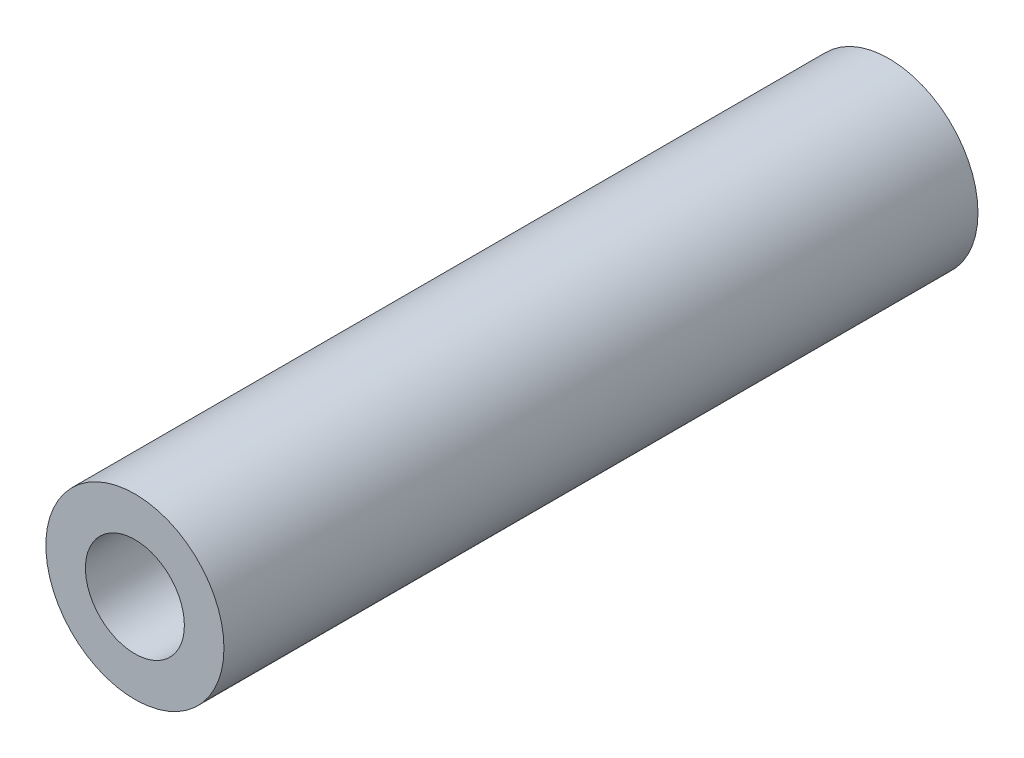
ISO-10303-21;
HEADER;
FILE_DESCRIPTION(('STEP AP214'),'2;1');
FILE_NAME('part.step','',(''),(''),'','','');
FILE_SCHEMA(('AUTOMOTIVE_DESIGN { 1 0 10303 214 1 1 1 1 }'));
ENDSEC;
DATA;
#1=APPLICATION_CONTEXT('core data for automotive mechanical design processes');
#2=APPLICATION_PROTOCOL_DEFINITION('international standard','automotive_design',2000,#1);
#3=PRODUCT_CONTEXT('',#1,'mechanical');
#4=PRODUCT('Part','Part','',(#3));
#5=PRODUCT_RELATED_PRODUCT_CATEGORY('part','',(#4));
#6=PRODUCT_DEFINITION_FORMATION('','',#4);
#7=PRODUCT_DEFINITION_CONTEXT('part definition',#1,'design');
#8=PRODUCT_DEFINITION('design','',#6,#7);
#9=PRODUCT_DEFINITION_SHAPE('','',#8);
#10=(LENGTH_UNIT() NAMED_UNIT(*) SI_UNIT(.MILLI.,.METRE.));
#11=(NAMED_UNIT(*) PLANE_ANGLE_UNIT() SI_UNIT($,.RADIAN.));
#12=(NAMED_UNIT(*) SI_UNIT($,.STERADIAN.) SOLID_ANGLE_UNIT());
#13=UNCERTAINTY_MEASURE_WITH_UNIT(LENGTH_MEASURE(1.E-05),#10,'distance_accuracy_value','');
#14=(GEOMETRIC_REPRESENTATION_CONTEXT(3) GLOBAL_UNCERTAINTY_ASSIGNED_CONTEXT((#13)) GLOBAL_UNIT_ASSIGNED_CONTEXT((#10,
#11,#12)) REPRESENTATION_CONTEXT('',''));
#15=CARTESIAN_POINT('',(0.,0.,0.));
#16=DIRECTION('',(0.,0.,1.));
#17=DIRECTION('',(1.,0.,0.));
#18=AXIS2_PLACEMENT_3D('',#15,#16,#17);
#19=CARTESIAN_POINT('',(0.,0.,7.62));
#20=DIRECTION('',(0.,0.,1.));
#21=DIRECTION('',(1.,0.,0.));
#22=AXIS2_PLACEMENT_3D('',#19,#20,#21);
#23=PLANE('',#22);
#24=CARTESIAN_POINT('',(0.,0.,7.62));
#25=DIRECTION('',(0.,0.,1.));
#26=DIRECTION('',(1.,0.,0.));
#27=AXIS2_PLACEMENT_3D('',#24,#25,#26);
#28=CIRCLE('',#27,0.900000000000002);
#29=CARTESIAN_POINT('',(0.900000000000002,0.,7.62));
#30=VERTEX_POINT('',#29);
#31=EDGE_CURVE('E10',#30,#30,#28,.T.);
#32=ORIENTED_EDGE('',*,*,#31,.T.);
#33=EDGE_LOOP('',(#32));
#34=FACE_BOUND('',#33,.T.);
#35=CARTESIAN_POINT('',(0.,0.,7.62));
#36=DIRECTION('',(0.,0.,1.));
#37=DIRECTION('',(1.,0.,0.));
#38=AXIS2_PLACEMENT_3D('',#35,#36,#37);
#39=CIRCLE('',#38,0.5);
#40=CARTESIAN_POINT('',(0.5,0.,7.62));
#41=VERTEX_POINT('',#40);
#42=EDGE_CURVE('E42',#41,#41,#39,.T.);
#43=ORIENTED_EDGE('',*,*,#42,.F.);
#44=EDGE_LOOP('',(#43));
#45=FACE_BOUND('',#44,.T.);
#46=ADVANCED_FACE('F31',(#34,#45),#23,.T.);
#47=CARTESIAN_POINT('',(0.,0.,0.));
#48=DIRECTION('',(0.,0.,1.));
#49=DIRECTION('',(1.,0.,0.));
#50=AXIS2_PLACEMENT_3D('',#47,#48,#49);
#51=PLANE('',#50);
#52=CARTESIAN_POINT('',(0.,0.,0.));
#53=DIRECTION('',(0.,0.,1.));
#54=DIRECTION('',(1.,0.,0.));
#55=AXIS2_PLACEMENT_3D('',#52,#53,#54);
#56=CIRCLE('',#55,0.900000000000002);
#57=CARTESIAN_POINT('',(0.900000000000002,0.,0.));
#58=VERTEX_POINT('',#57);
#59=EDGE_CURVE('E35',#58,#58,#56,.T.);
#60=ORIENTED_EDGE('',*,*,#59,.F.);
#61=EDGE_LOOP('',(#60));
#62=FACE_BOUND('',#61,.T.);
#63=CARTESIAN_POINT('',(0.,0.,0.));
#64=DIRECTION('',(0.,0.,1.));
#65=DIRECTION('',(1.,0.,0.));
#66=AXIS2_PLACEMENT_3D('',#63,#64,#65);
#67=CIRCLE('',#66,0.5);
#68=CARTESIAN_POINT('',(0.5,0.,0.));
#69=VERTEX_POINT('',#68);
#70=EDGE_CURVE('E44',#69,#69,#67,.T.);
#71=ORIENTED_EDGE('',*,*,#70,.T.);
#72=EDGE_LOOP('',(#71));
#73=FACE_BOUND('',#72,.T.);
#74=ADVANCED_FACE('F54',(#62,#73),#51,.F.);
#75=CARTESIAN_POINT('',(0.,0.,7.62));
#76=DIRECTION('',(0.,0.,-1.));
#77=DIRECTION('',(-1.,0.,0.));
#78=AXIS2_PLACEMENT_3D('',#75,#76,#77);
#79=CYLINDRICAL_SURFACE('',#78,0.900000000000002);
#80=ORIENTED_EDGE('',*,*,#31,.F.);
#81=EDGE_LOOP('',(#80));
#82=FACE_BOUND('',#81,.T.);
#83=ORIENTED_EDGE('',*,*,#59,.T.);
#84=EDGE_LOOP('',(#83));
#85=FACE_BOUND('',#84,.T.);
#86=ADVANCED_FACE('F33',(#82,#85),#79,.T.);
#87=CARTESIAN_POINT('',(0.,0.,7.62));
#88=DIRECTION('',(0.,0.,-1.));
#89=DIRECTION('',(-1.,0.,0.));
#90=AXIS2_PLACEMENT_3D('',#87,#88,#89);
#91=CYLINDRICAL_SURFACE('',#90,0.5);
#92=ORIENTED_EDGE('',*,*,#42,.T.);
#93=EDGE_LOOP('',(#92));
#94=FACE_BOUND('',#93,.T.);
#95=ORIENTED_EDGE('',*,*,#70,.F.);
#96=EDGE_LOOP('',(#95));
#97=FACE_BOUND('',#96,.T.);
#98=ADVANCED_FACE('F50',(#94,#97),#91,.F.);
#99=CLOSED_SHELL('',(#46,#74,#86,#98));
#100=MANIFOLD_SOLID_BREP('B2',#99);
#101=ADVANCED_BREP_SHAPE_REPRESENTATION('',(#18,#100),#14);
#102=SHAPE_DEFINITION_REPRESENTATION(#9,#101);
ENDSEC;
END-ISO-10303-21;
